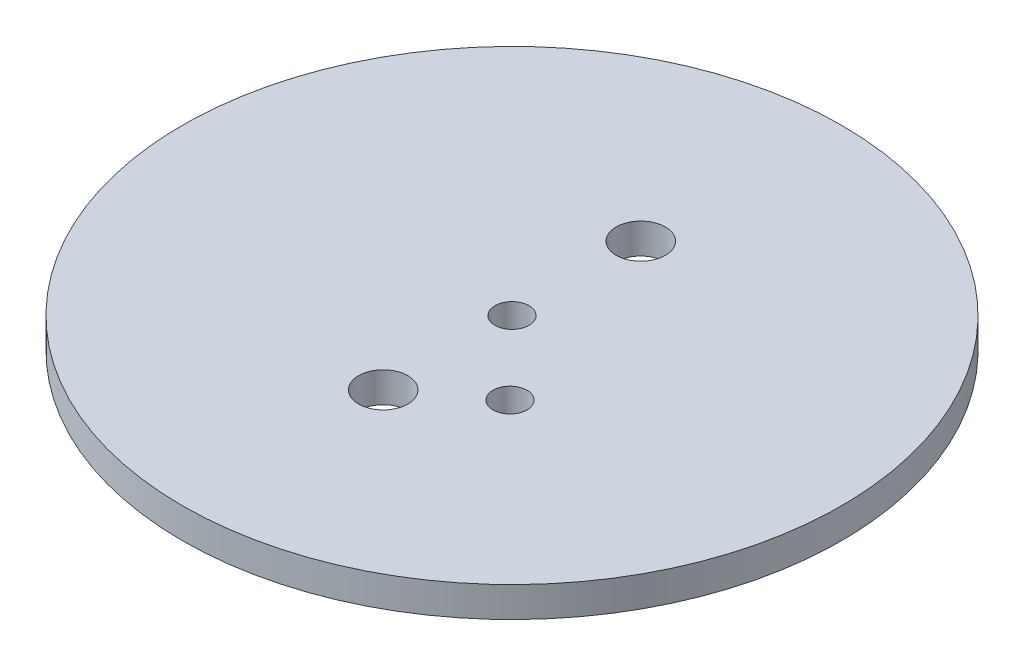
ISO-10303-21;
HEADER;
FILE_DESCRIPTION(('STEP AP214'),'2;1');
FILE_NAME('part.step','',(''),(''),'','','');
FILE_SCHEMA(('AUTOMOTIVE_DESIGN { 1 0 10303 214 1 1 1 1 }'));
ENDSEC;
DATA;
#1=APPLICATION_CONTEXT('core data for automotive mechanical design processes');
#2=APPLICATION_PROTOCOL_DEFINITION('international standard','automotive_design',2000,#1);
#3=PRODUCT_CONTEXT('',#1,'mechanical');
#4=PRODUCT('Part','Part','',(#3));
#5=PRODUCT_RELATED_PRODUCT_CATEGORY('part','',(#4));
#6=PRODUCT_DEFINITION_FORMATION('','',#4);
#7=PRODUCT_DEFINITION_CONTEXT('part definition',#1,'design');
#8=PRODUCT_DEFINITION('design','',#6,#7);
#9=PRODUCT_DEFINITION_SHAPE('','',#8);
#10=(LENGTH_UNIT() NAMED_UNIT(*) SI_UNIT(.MILLI.,.METRE.));
#11=(NAMED_UNIT(*) PLANE_ANGLE_UNIT() SI_UNIT($,.RADIAN.));
#12=(NAMED_UNIT(*) SI_UNIT($,.STERADIAN.) SOLID_ANGLE_UNIT());
#13=UNCERTAINTY_MEASURE_WITH_UNIT(LENGTH_MEASURE(1.E-05),#10,'distance_accuracy_value','');
#14=(GEOMETRIC_REPRESENTATION_CONTEXT(3) GLOBAL_UNCERTAINTY_ASSIGNED_CONTEXT((#13)) GLOBAL_UNIT_ASSIGNED_CONTEXT((#10,
#11,#12)) REPRESENTATION_CONTEXT('',''));
#15=CARTESIAN_POINT('',(0.,0.,0.));
#16=DIRECTION('',(0.,0.,1.));
#17=DIRECTION('',(1.,0.,0.));
#18=AXIS2_PLACEMENT_3D('',#15,#16,#17);
#19=CARTESIAN_POINT('',(0.,6.35,0.));
#20=DIRECTION('',(0.,-1.,0.));
#21=DIRECTION('',(0.,0.,-1.));
#22=AXIS2_PLACEMENT_3D('',#19,#20,#21);
#23=CYLINDRICAL_SURFACE('',#22,69.05625);
#24=CARTESIAN_POINT('',(0.,6.35,0.));
#25=DIRECTION('',(0.,1.,0.));
#26=DIRECTION('',(0.,0.,1.));
#27=AXIS2_PLACEMENT_3D('',#24,#25,#26);
#28=CIRCLE('',#27,69.05625);
#29=CARTESIAN_POINT('',(0.,6.35,69.05625));
#30=VERTEX_POINT('',#29);
#31=EDGE_CURVE('E10',#30,#30,#28,.T.);
#32=ORIENTED_EDGE('',*,*,#31,.F.);
#33=EDGE_LOOP('',(#32));
#34=FACE_BOUND('',#33,.T.);
#35=CARTESIAN_POINT('',(0.,0.,0.));
#36=DIRECTION('',(0.,1.,0.));
#37=DIRECTION('',(0.,0.,1.));
#38=AXIS2_PLACEMENT_3D('',#35,#36,#37);
#39=CIRCLE('',#38,69.05625);
#40=CARTESIAN_POINT('',(0.,0.,69.05625));
#41=VERTEX_POINT('',#40);
#42=EDGE_CURVE('E44',#41,#41,#39,.T.);
#43=ORIENTED_EDGE('',*,*,#42,.T.);
#44=EDGE_LOOP('',(#43));
#45=FACE_BOUND('',#44,.T.);
#46=ADVANCED_FACE('F41',(#34,#45),#23,.T.);
#47=CARTESIAN_POINT('',(0.,6.35,0.));
#48=DIRECTION('',(0.,1.,0.));
#49=DIRECTION('',(0.,0.,1.));
#50=AXIS2_PLACEMENT_3D('',#47,#48,#49);
#51=PLANE('',#50);
#52=CARTESIAN_POINT('',(15.1384,6.35,15.5575));
#53=DIRECTION('',(0.,1.,0.));
#54=DIRECTION('',(0.,0.,1.));
#55=AXIS2_PLACEMENT_3D('',#52,#53,#54);
#56=CIRCLE('',#55,3.57124);
#57=CARTESIAN_POINT('',(15.1384,6.35,19.12874));
#58=VERTEX_POINT('',#57);
#59=EDGE_CURVE('E82',#58,#58,#56,.T.);
#60=ORIENTED_EDGE('',*,*,#59,.F.);
#61=EDGE_LOOP('',(#60));
#62=FACE_BOUND('',#61,.T.);
#63=CARTESIAN_POINT('',(0.,6.35,-26.9875));
#64=DIRECTION('',(0.,1.,0.));
#65=DIRECTION('',(0.,0.,1.));
#66=AXIS2_PLACEMENT_3D('',#63,#64,#65);
#67=CIRCLE('',#66,5.15873999999999);
#68=CARTESIAN_POINT('',(0.,6.35,-21.82876));
#69=VERTEX_POINT('',#68);
#70=EDGE_CURVE('E74',#69,#69,#67,.T.);
#71=ORIENTED_EDGE('',*,*,#70,.F.);
#72=EDGE_LOOP('',(#71));
#73=FACE_BOUND('',#72,.T.);
#74=CARTESIAN_POINT('',(0.,6.35,26.9875));
#75=DIRECTION('',(0.,1.,0.));
#76=DIRECTION('',(0.,0.,1.));
#77=AXIS2_PLACEMENT_3D('',#74,#75,#76);
#78=CIRCLE('',#77,5.15873999999999);
#79=CARTESIAN_POINT('',(0.,6.35,32.14624));
#80=VERTEX_POINT('',#79);
#81=EDGE_CURVE('E66',#80,#80,#78,.T.);
#82=ORIENTED_EDGE('',*,*,#81,.F.);
#83=EDGE_LOOP('',(#82));
#84=FACE_BOUND('',#83,.T.);
#85=CARTESIAN_POINT('',(0.,6.35,0.));
#86=DIRECTION('',(0.,1.,0.));
#87=DIRECTION('',(0.,0.,1.));
#88=AXIS2_PLACEMENT_3D('',#85,#86,#87);
#89=CIRCLE('',#88,3.57124);
#90=CARTESIAN_POINT('',(0.,6.35,3.57124));
#91=VERTEX_POINT('',#90);
#92=EDGE_CURVE('E58',#91,#91,#89,.T.);
#93=ORIENTED_EDGE('',*,*,#92,.F.);
#94=EDGE_LOOP('',(#93));
#95=FACE_BOUND('',#94,.T.);
#96=ORIENTED_EDGE('',*,*,#31,.T.);
#97=EDGE_LOOP('',(#96));
#98=FACE_BOUND('',#97,.T.);
#99=ADVANCED_FACE('F89',(#62,#73,#84,#95,#98),#51,.T.);
#100=CARTESIAN_POINT('',(0.,0.,0.));
#101=DIRECTION('',(0.,1.,0.));
#102=DIRECTION('',(0.,0.,1.));
#103=AXIS2_PLACEMENT_3D('',#100,#101,#102);
#104=PLANE('',#103);
#105=CARTESIAN_POINT('',(15.1384,0.,15.5575));
#106=DIRECTION('',(0.,1.,0.));
#107=DIRECTION('',(0.,0.,1.));
#108=AXIS2_PLACEMENT_3D('',#105,#106,#107);
#109=CIRCLE('',#108,3.57124);
#110=CARTESIAN_POINT('',(15.1384,0.,19.12874));
#111=VERTEX_POINT('',#110);
#112=EDGE_CURVE('E78',#111,#111,#109,.F.);
#113=ORIENTED_EDGE('',*,*,#112,.F.);
#114=EDGE_LOOP('',(#113));
#115=FACE_BOUND('',#114,.T.);
#116=CARTESIAN_POINT('',(0.,0.,-26.9875));
#117=DIRECTION('',(0.,1.,0.));
#118=DIRECTION('',(0.,0.,1.));
#119=AXIS2_PLACEMENT_3D('',#116,#117,#118);
#120=CIRCLE('',#119,5.15873999999999);
#121=CARTESIAN_POINT('',(0.,0.,-21.82876));
#122=VERTEX_POINT('',#121);
#123=EDGE_CURVE('E70',#122,#122,#120,.T.);
#124=ORIENTED_EDGE('',*,*,#123,.T.);
#125=EDGE_LOOP('',(#124));
#126=FACE_BOUND('',#125,.T.);
#127=CARTESIAN_POINT('',(0.,0.,26.9875));
#128=DIRECTION('',(0.,1.,0.));
#129=DIRECTION('',(0.,0.,1.));
#130=AXIS2_PLACEMENT_3D('',#127,#128,#129);
#131=CIRCLE('',#130,5.15873999999999);
#132=CARTESIAN_POINT('',(0.,0.,32.14624));
#133=VERTEX_POINT('',#132);
#134=EDGE_CURVE('E62',#133,#133,#131,.T.);
#135=ORIENTED_EDGE('',*,*,#134,.T.);
#136=EDGE_LOOP('',(#135));
#137=FACE_BOUND('',#136,.T.);
#138=CARTESIAN_POINT('',(0.,0.,0.));
#139=DIRECTION('',(0.,1.,0.));
#140=DIRECTION('',(0.,0.,1.));
#141=AXIS2_PLACEMENT_3D('',#138,#139,#140);
#142=CIRCLE('',#141,3.57124);
#143=CARTESIAN_POINT('',(0.,0.,3.57124));
#144=VERTEX_POINT('',#143);
#145=EDGE_CURVE('E53',#144,#144,#142,.T.);
#146=ORIENTED_EDGE('',*,*,#145,.T.);
#147=EDGE_LOOP('',(#146));
#148=FACE_BOUND('',#147,.T.);
#149=ORIENTED_EDGE('',*,*,#42,.F.);
#150=EDGE_LOOP('',(#149));
#151=FACE_BOUND('',#150,.T.);
#152=ADVANCED_FACE('F92',(#115,#126,#137,#148,#151),#104,.F.);
#153=CARTESIAN_POINT('',(0.,6.35,0.));
#154=DIRECTION('',(0.,1.,0.));
#155=DIRECTION('',(0.,0.,1.));
#156=AXIS2_PLACEMENT_3D('',#153,#154,#155);
#157=CYLINDRICAL_SURFACE('',#156,3.57124);
#158=ORIENTED_EDGE('',*,*,#145,.F.);
#159=EDGE_LOOP('',(#158));
#160=FACE_BOUND('',#159,.T.);
#161=ORIENTED_EDGE('',*,*,#92,.T.);
#162=EDGE_LOOP('',(#161));
#163=FACE_BOUND('',#162,.T.);
#164=ADVANCED_FACE('F100',(#160,#163),#157,.F.);
#165=CARTESIAN_POINT('',(0.,6.35,26.9875));
#166=DIRECTION('',(0.,1.,0.));
#167=DIRECTION('',(0.,0.,1.));
#168=AXIS2_PLACEMENT_3D('',#165,#166,#167);
#169=CYLINDRICAL_SURFACE('',#168,5.15873999999999);
#170=ORIENTED_EDGE('',*,*,#134,.F.);
#171=EDGE_LOOP('',(#170));
#172=FACE_BOUND('',#171,.T.);
#173=ORIENTED_EDGE('',*,*,#81,.T.);
#174=EDGE_LOOP('',(#173));
#175=FACE_BOUND('',#174,.T.);
#176=ADVANCED_FACE('F102',(#172,#175),#169,.F.);
#177=CARTESIAN_POINT('',(0.,6.35,-26.9875));
#178=DIRECTION('',(0.,1.,0.));
#179=DIRECTION('',(0.,0.,1.));
#180=AXIS2_PLACEMENT_3D('',#177,#178,#179);
#181=CYLINDRICAL_SURFACE('',#180,5.15873999999999);
#182=ORIENTED_EDGE('',*,*,#123,.F.);
#183=EDGE_LOOP('',(#182));
#184=FACE_BOUND('',#183,.T.);
#185=ORIENTED_EDGE('',*,*,#70,.T.);
#186=EDGE_LOOP('',(#185));
#187=FACE_BOUND('',#186,.T.);
#188=ADVANCED_FACE('F109',(#184,#187),#181,.F.);
#189=CARTESIAN_POINT('',(15.1384,-10.1009920849786,15.5575));
#190=DIRECTION('',(0.,1.,0.));
#191=DIRECTION('',(0.,0.,1.));
#192=AXIS2_PLACEMENT_3D('',#189,#190,#191);
#193=CYLINDRICAL_SURFACE('',#192,3.57124);
#194=ORIENTED_EDGE('',*,*,#112,.T.);
#195=EDGE_LOOP('',(#194));
#196=FACE_BOUND('',#195,.T.);
#197=ORIENTED_EDGE('',*,*,#59,.T.);
#198=EDGE_LOOP('',(#197));
#199=FACE_BOUND('',#198,.T.);
#200=ADVANCED_FACE('F87',(#196,#199),#193,.F.);
#201=CLOSED_SHELL('',(#46,#99,#152,#164,#176,#188,#200));
#202=MANIFOLD_SOLID_BREP('B2',#201);
#203=ADVANCED_BREP_SHAPE_REPRESENTATION('',(#18,#202),#14);
#204=SHAPE_DEFINITION_REPRESENTATION(#9,#203);
ENDSEC;
END-ISO-10303-21;
